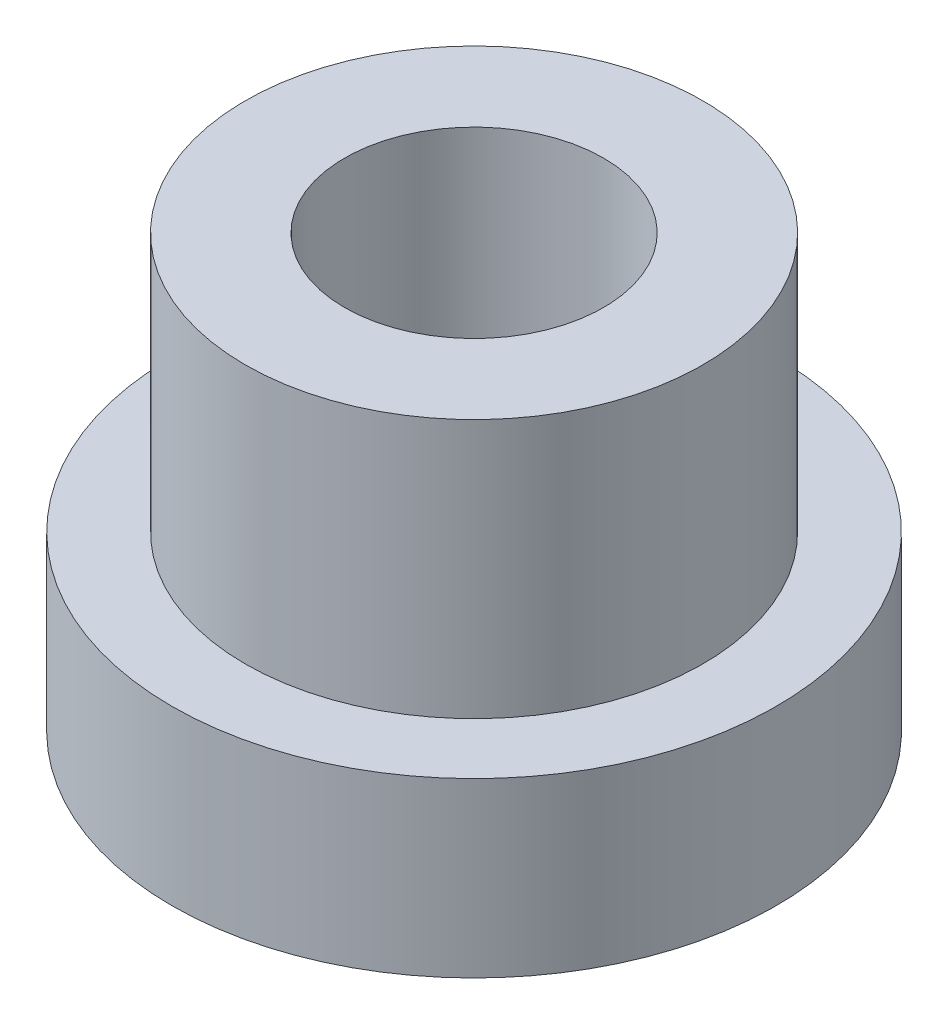
ISO-10303-21;
HEADER;
FILE_DESCRIPTION(('STEP AP214'),'2;1');
FILE_NAME('part.step','',(''),(''),'','','');
FILE_SCHEMA(('AUTOMOTIVE_DESIGN { 1 0 10303 214 1 1 1 1 }'));
ENDSEC;
DATA;
#1=APPLICATION_CONTEXT('core data for automotive mechanical design processes');
#2=APPLICATION_PROTOCOL_DEFINITION('international standard','automotive_design',2000,#1);
#3=PRODUCT_CONTEXT('',#1,'mechanical');
#4=PRODUCT('Part','Part','',(#3));
#5=PRODUCT_RELATED_PRODUCT_CATEGORY('part','',(#4));
#6=PRODUCT_DEFINITION_FORMATION('','',#4);
#7=PRODUCT_DEFINITION_CONTEXT('part definition',#1,'design');
#8=PRODUCT_DEFINITION('design','',#6,#7);
#9=PRODUCT_DEFINITION_SHAPE('','',#8);
#10=(LENGTH_UNIT() NAMED_UNIT(*) SI_UNIT(.MILLI.,.METRE.));
#11=(NAMED_UNIT(*) PLANE_ANGLE_UNIT() SI_UNIT($,.RADIAN.));
#12=(NAMED_UNIT(*) SI_UNIT($,.STERADIAN.) SOLID_ANGLE_UNIT());
#13=UNCERTAINTY_MEASURE_WITH_UNIT(LENGTH_MEASURE(1.E-05),#10,'distance_accuracy_value','');
#14=(GEOMETRIC_REPRESENTATION_CONTEXT(3) GLOBAL_UNCERTAINTY_ASSIGNED_CONTEXT((#13)) GLOBAL_UNIT_ASSIGNED_CONTEXT((#10,
#11,#12)) REPRESENTATION_CONTEXT('',''));
#15=CARTESIAN_POINT('',(0.,0.,0.));
#16=DIRECTION('',(0.,0.,1.));
#17=DIRECTION('',(1.,0.,0.));
#18=AXIS2_PLACEMENT_3D('',#15,#16,#17);
#19=CARTESIAN_POINT('',(0.,2.,0.));
#20=DIRECTION('',(0.,-1.,0.));
#21=DIRECTION('',(0.,0.,-1.));
#22=AXIS2_PLACEMENT_3D('',#19,#20,#21);
#23=CYLINDRICAL_SURFACE('',#22,3.5);
#24=CARTESIAN_POINT('',(0.,2.,0.));
#25=DIRECTION('',(0.,1.,0.));
#26=DIRECTION('',(0.,0.,1.));
#27=AXIS2_PLACEMENT_3D('',#24,#25,#26);
#28=CIRCLE('',#27,3.5);
#29=CARTESIAN_POINT('',(0.,2.,3.5));
#30=VERTEX_POINT('',#29);
#31=EDGE_CURVE('E37',#30,#30,#28,.T.);
#32=ORIENTED_EDGE('',*,*,#31,.F.);
#33=EDGE_LOOP('',(#32));
#34=FACE_BOUND('',#33,.T.);
#35=CARTESIAN_POINT('',(0.,0.,0.));
#36=DIRECTION('',(0.,1.,0.));
#37=DIRECTION('',(0.,0.,1.));
#38=AXIS2_PLACEMENT_3D('',#35,#36,#37);
#39=CIRCLE('',#38,3.5);
#40=CARTESIAN_POINT('',(0.,0.,3.5));
#41=VERTEX_POINT('',#40);
#42=EDGE_CURVE('E33',#41,#41,#39,.T.);
#43=ORIENTED_EDGE('',*,*,#42,.T.);
#44=EDGE_LOOP('',(#43));
#45=FACE_BOUND('',#44,.T.);
#46=ADVANCED_FACE('F30',(#34,#45),#23,.T.);
#47=CARTESIAN_POINT('',(0.,2.,0.));
#48=DIRECTION('',(0.,1.,0.));
#49=DIRECTION('',(0.,0.,1.));
#50=AXIS2_PLACEMENT_3D('',#47,#48,#49);
#51=PLANE('',#50);
#52=CARTESIAN_POINT('',(0.,2.,0.));
#53=DIRECTION('',(0.,1.,0.));
#54=DIRECTION('',(0.,0.,1.));
#55=AXIS2_PLACEMENT_3D('',#52,#53,#54);
#56=CIRCLE('',#55,2.65);
#57=CARTESIAN_POINT('',(0.,2.,2.65));
#58=VERTEX_POINT('',#57);
#59=EDGE_CURVE('E10',#58,#58,#56,.T.);
#60=ORIENTED_EDGE('',*,*,#59,.F.);
#61=EDGE_LOOP('',(#60));
#62=FACE_BOUND('',#61,.T.);
#63=ORIENTED_EDGE('',*,*,#31,.T.);
#64=EDGE_LOOP('',(#63));
#65=FACE_BOUND('',#64,.T.);
#66=ADVANCED_FACE('F74',(#62,#65),#51,.T.);
#67=CARTESIAN_POINT('',(0.,0.,0.));
#68=DIRECTION('',(0.,1.,0.));
#69=DIRECTION('',(0.,0.,1.));
#70=AXIS2_PLACEMENT_3D('',#67,#68,#69);
#71=PLANE('',#70);
#72=ORIENTED_EDGE('',*,*,#42,.F.);
#73=EDGE_LOOP('',(#72));
#74=FACE_BOUND('',#73,.T.);
#75=ADVANCED_FACE('F69',(#74),#71,.F.);
#76=CARTESIAN_POINT('',(0.,5.,0.));
#77=DIRECTION('',(0.,-1.,0.));
#78=DIRECTION('',(0.,0.,-1.));
#79=AXIS2_PLACEMENT_3D('',#76,#77,#78);
#80=CYLINDRICAL_SURFACE('',#79,2.65);
#81=CARTESIAN_POINT('',(0.,5.,0.));
#82=DIRECTION('',(0.,1.,0.));
#83=DIRECTION('',(0.,0.,1.));
#84=AXIS2_PLACEMENT_3D('',#81,#82,#83);
#85=CIRCLE('',#84,2.65);
#86=CARTESIAN_POINT('',(0.,5.,2.65));
#87=VERTEX_POINT('',#86);
#88=EDGE_CURVE('E43',#87,#87,#85,.T.);
#89=ORIENTED_EDGE('',*,*,#88,.F.);
#90=EDGE_LOOP('',(#89));
#91=FACE_BOUND('',#90,.T.);
#92=ORIENTED_EDGE('',*,*,#59,.T.);
#93=EDGE_LOOP('',(#92));
#94=FACE_BOUND('',#93,.T.);
#95=ADVANCED_FACE('F64',(#91,#94),#80,.T.);
#96=CARTESIAN_POINT('',(0.,5.,0.));
#97=DIRECTION('',(0.,1.,0.));
#98=DIRECTION('',(0.,0.,1.));
#99=AXIS2_PLACEMENT_3D('',#96,#97,#98);
#100=PLANE('',#99);
#101=CARTESIAN_POINT('',(0.,5.,0.));
#102=DIRECTION('',(0.,1.,0.));
#103=DIRECTION('',(0.,0.,1.));
#104=AXIS2_PLACEMENT_3D('',#101,#102,#103);
#105=CIRCLE('',#104,1.5);
#106=CARTESIAN_POINT('',(0.,5.,1.5));
#107=VERTEX_POINT('',#106);
#108=EDGE_CURVE('E47',#107,#107,#105,.T.);
#109=ORIENTED_EDGE('',*,*,#108,.F.);
#110=EDGE_LOOP('',(#109));
#111=FACE_BOUND('',#110,.T.);
#112=ORIENTED_EDGE('',*,*,#88,.T.);
#113=EDGE_LOOP('',(#112));
#114=FACE_BOUND('',#113,.T.);
#115=ADVANCED_FACE('F58',(#111,#114),#100,.T.);
#116=CARTESIAN_POINT('',(0.,1.,0.));
#117=DIRECTION('',(0.,1.,0.));
#118=DIRECTION('',(0.,0.,1.));
#119=AXIS2_PLACEMENT_3D('',#116,#117,#118);
#120=CYLINDRICAL_SURFACE('',#119,1.5);
#121=CARTESIAN_POINT('',(0.,1.,0.));
#122=DIRECTION('',(0.,1.,0.));
#123=DIRECTION('',(0.,0.,1.));
#124=AXIS2_PLACEMENT_3D('',#121,#122,#123);
#125=CIRCLE('',#124,1.5);
#126=CARTESIAN_POINT('',(0.,1.,1.5));
#127=VERTEX_POINT('',#126);
#128=EDGE_CURVE('E46',#127,#127,#125,.T.);
#129=ORIENTED_EDGE('',*,*,#128,.F.);
#130=EDGE_LOOP('',(#129));
#131=FACE_BOUND('',#130,.T.);
#132=ORIENTED_EDGE('',*,*,#108,.T.);
#133=EDGE_LOOP('',(#132));
#134=FACE_BOUND('',#133,.T.);
#135=ADVANCED_FACE('F55',(#131,#134),#120,.F.);
#136=CARTESIAN_POINT('',(0.,1.,0.));
#137=DIRECTION('',(0.,1.,0.));
#138=DIRECTION('',(0.,0.,1.));
#139=AXIS2_PLACEMENT_3D('',#136,#137,#138);
#140=PLANE('',#139);
#141=ORIENTED_EDGE('',*,*,#128,.T.);
#142=EDGE_LOOP('',(#141));
#143=FACE_BOUND('',#142,.T.);
#144=ADVANCED_FACE('F53',(#143),#140,.T.);
#145=CLOSED_SHELL('',(#46,#66,#75,#95,#115,#135,#144));
#146=MANIFOLD_SOLID_BREP('B2',#145);
#147=ADVANCED_BREP_SHAPE_REPRESENTATION('',(#18,#146),#14);
#148=SHAPE_DEFINITION_REPRESENTATION(#9,#147);
ENDSEC;
END-ISO-10303-21;
